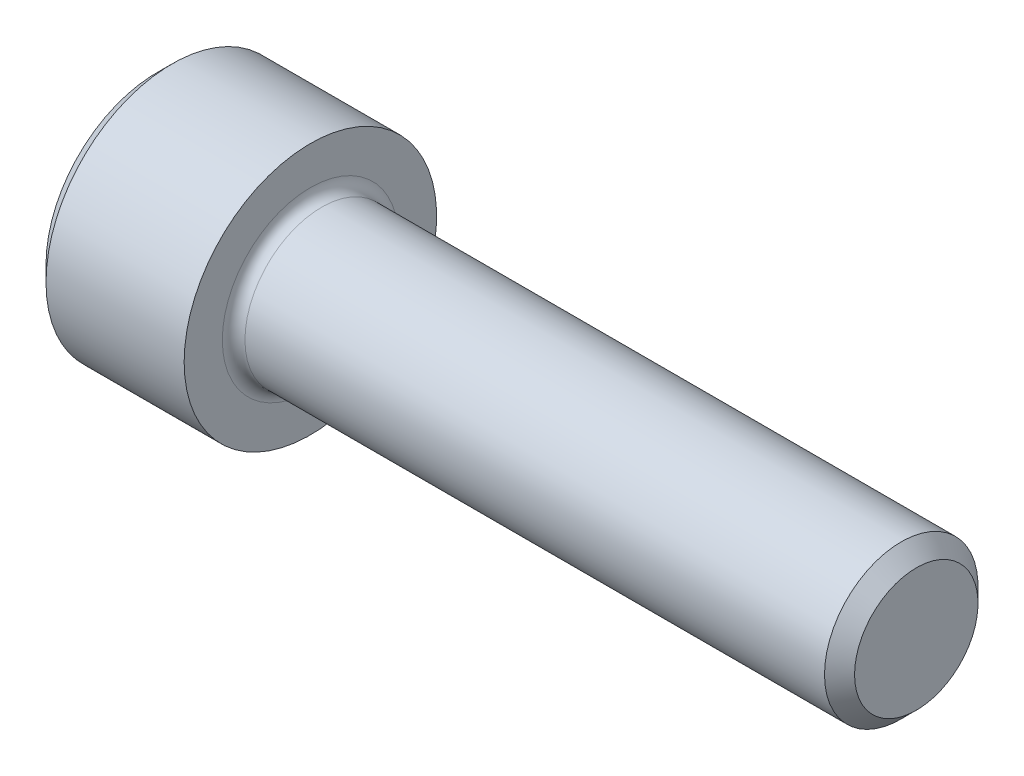
ISO-10303-21;
HEADER;
FILE_DESCRIPTION(('STEP AP214'),'2;1');
FILE_NAME('part.step','',(''),(''),'','','');
FILE_SCHEMA(('AUTOMOTIVE_DESIGN { 1 0 10303 214 1 1 1 1 }'));
ENDSEC;
DATA;
#1=APPLICATION_CONTEXT('core data for automotive mechanical design processes');
#2=APPLICATION_PROTOCOL_DEFINITION('international standard','automotive_design',2000,#1);
#3=PRODUCT_CONTEXT('',#1,'mechanical');
#4=PRODUCT('Part','Part','',(#3));
#5=PRODUCT_RELATED_PRODUCT_CATEGORY('part','',(#4));
#6=PRODUCT_DEFINITION_FORMATION('','',#4);
#7=PRODUCT_DEFINITION_CONTEXT('part definition',#1,'design');
#8=PRODUCT_DEFINITION('design','',#6,#7);
#9=PRODUCT_DEFINITION_SHAPE('','',#8);
#10=(LENGTH_UNIT() NAMED_UNIT(*) SI_UNIT(.MILLI.,.METRE.));
#11=(NAMED_UNIT(*) PLANE_ANGLE_UNIT() SI_UNIT($,.RADIAN.));
#12=(NAMED_UNIT(*) SI_UNIT($,.STERADIAN.) SOLID_ANGLE_UNIT());
#13=UNCERTAINTY_MEASURE_WITH_UNIT(LENGTH_MEASURE(1.E-05),#10,'distance_accuracy_value','');
#14=(GEOMETRIC_REPRESENTATION_CONTEXT(3) GLOBAL_UNCERTAINTY_ASSIGNED_CONTEXT((#13)) GLOBAL_UNIT_ASSIGNED_CONTEXT((#10,
#11,#12)) REPRESENTATION_CONTEXT('',''));
#15=CARTESIAN_POINT('',(0.,0.,0.));
#16=DIRECTION('',(0.,0.,1.));
#17=DIRECTION('',(1.,0.,0.));
#18=AXIS2_PLACEMENT_3D('',#15,#16,#17);
#19=CARTESIAN_POINT('',(2.286,3.4381381735323,-1.98501));
#20=DIRECTION('',(1.,0.,0.));
#21=DIRECTION('',(0.,0.,-1.));
#22=AXIS2_PLACEMENT_3D('',#19,#20,#21);
#23=PLANE('',#22);
#24=DIRECTION('',(0.,1.,0.));
#25=VECTOR('',#24,1.);
#26=CARTESIAN_POINT('',(2.286,3.4381381735323,1.98501));
#27=LINE('',#26,#25);
#28=CARTESIAN_POINT('',(2.28600000003503,0.,1.985009999957));
#29=VERTEX_POINT('',#28);
#30=CARTESIAN_POINT('',(2.286,-1.14604605784409,1.98501));
#31=VERTEX_POINT('',#30);
#32=EDGE_CURVE('E95',#29,#31,#27,.F.);
#33=ORIENTED_EDGE('',*,*,#32,.F.);
#34=CARTESIAN_POINT('',(2.28600000004166,0.,0.));
#35=DIRECTION('',(-1.,0.,0.));
#36=DIRECTION('',(0.,0.,1.));
#37=AXIS2_PLACEMENT_3D('',#34,#35,#36);
#38=CIRCLE('',#37,1.98500999999851);
#39=CARTESIAN_POINT('',(2.28600000002083,-1.7190690867655,0.992504999999628));
#40=VERTEX_POINT('',#39);
#41=EDGE_CURVE('E97',#29,#40,#38,.F.);
#42=ORIENTED_EDGE('',*,*,#41,.T.);
#43=DIRECTION('',(0.,-0.500000000000001,-0.866025403784438));
#44=VECTOR('',#43,1.);
#45=CARTESIAN_POINT('',(2.286,-1.14604605784409,1.98501));
#46=LINE('',#45,#44);
#47=EDGE_CURVE('E100',#31,#40,#46,.T.);
#48=ORIENTED_EDGE('',*,*,#47,.F.);
#49=EDGE_LOOP('',(#33,#42,#48));
#50=FACE_BOUND('',#49,.T.);
#51=ADVANCED_FACE('F16',(#50),#23,.F.);
#52=CARTESIAN_POINT('',(2.286,3.4381381735323,-1.98501));
#53=DIRECTION('',(1.,0.,0.));
#54=DIRECTION('',(0.,0.,-1.));
#55=AXIS2_PLACEMENT_3D('',#52,#53,#54);
#56=PLANE('',#55);
#57=DIRECTION('',(0.,-0.500000000000001,-0.866025403784438));
#58=VECTOR('',#57,1.);
#59=CARTESIAN_POINT('',(2.286,-1.71906908676614,0.992505));
#60=LINE('',#59,#58);
#61=CARTESIAN_POINT('',(2.286,-2.29209211568819,0.));
#62=VERTEX_POINT('',#61);
#63=EDGE_CURVE('E168',#40,#62,#60,.T.);
#64=ORIENTED_EDGE('',*,*,#63,.F.);
#65=CARTESIAN_POINT('',(2.28600000004166,0.,0.));
#66=DIRECTION('',(-1.,0.,0.));
#67=DIRECTION('',(0.,0.,1.));
#68=AXIS2_PLACEMENT_3D('',#65,#66,#67);
#69=CIRCLE('',#68,1.98500999999851);
#70=CARTESIAN_POINT('',(2.28600000002083,-1.7190690867655,-0.992504999999625));
#71=VERTEX_POINT('',#70);
#72=EDGE_CURVE('E115',#40,#71,#69,.F.);
#73=ORIENTED_EDGE('',*,*,#72,.T.);
#74=DIRECTION('',(0.,0.5,-0.866025403784439));
#75=VECTOR('',#74,1.);
#76=CARTESIAN_POINT('',(2.286,-2.29209211568819,0.));
#77=LINE('',#76,#75);
#78=EDGE_CURVE('E164',#62,#71,#77,.T.);
#79=ORIENTED_EDGE('',*,*,#78,.F.);
#80=EDGE_LOOP('',(#64,#73,#79));
#81=FACE_BOUND('',#80,.T.);
#82=ADVANCED_FACE('F340',(#81),#56,.F.);
#83=CARTESIAN_POINT('',(2.286,3.4381381735323,-1.98501));
#84=DIRECTION('',(1.,0.,0.));
#85=DIRECTION('',(0.,0.,-1.));
#86=AXIS2_PLACEMENT_3D('',#83,#84,#85);
#87=PLANE('',#86);
#88=DIRECTION('',(0.,0.499999999999998,-0.86602540378444));
#89=VECTOR('',#88,1.);
#90=CARTESIAN_POINT('',(2.286,-1.71906908676615,-0.992504999999995));
#91=LINE('',#90,#89);
#92=CARTESIAN_POINT('',(2.286,-1.1460460578441,-1.98501));
#93=VERTEX_POINT('',#92);
#94=EDGE_CURVE('E160',#71,#93,#91,.T.);
#95=ORIENTED_EDGE('',*,*,#94,.F.);
#96=CARTESIAN_POINT('',(2.28600000004166,0.,0.));
#97=DIRECTION('',(-1.,0.,0.));
#98=DIRECTION('',(0.,0.,1.));
#99=AXIS2_PLACEMENT_3D('',#96,#97,#98);
#100=CIRCLE('',#99,1.98500999999851);
#101=CARTESIAN_POINT('',(2.28600000003503,0.,-1.985009999957));
#102=VERTEX_POINT('',#101);
#103=EDGE_CURVE('E217',#71,#102,#100,.F.);
#104=ORIENTED_EDGE('',*,*,#103,.T.);
#105=DIRECTION('',(0.,1.,0.));
#106=VECTOR('',#105,1.);
#107=CARTESIAN_POINT('',(2.286,3.4381381735323,-1.98501));
#108=LINE('',#107,#106);
#109=EDGE_CURVE('E156',#93,#102,#108,.T.);
#110=ORIENTED_EDGE('',*,*,#109,.F.);
#111=EDGE_LOOP('',(#95,#104,#110));
#112=FACE_BOUND('',#111,.T.);
#113=ADVANCED_FACE('F337',(#112),#87,.F.);
#114=CARTESIAN_POINT('',(2.286,3.4381381735323,-1.98501));
#115=DIRECTION('',(1.,0.,0.));
#116=DIRECTION('',(0.,0.,-1.));
#117=AXIS2_PLACEMENT_3D('',#114,#115,#116);
#118=PLANE('',#117);
#119=DIRECTION('',(0.,1.,0.));
#120=VECTOR('',#119,1.);
#121=CARTESIAN_POINT('',(2.286,3.4381381735323,-1.98501));
#122=LINE('',#121,#120);
#123=CARTESIAN_POINT('',(2.286,1.1460460578441,-1.98501));
#124=VERTEX_POINT('',#123);
#125=EDGE_CURVE('E152',#102,#124,#122,.T.);
#126=ORIENTED_EDGE('',*,*,#125,.F.);
#127=CARTESIAN_POINT('',(2.28600000004166,0.,0.));
#128=DIRECTION('',(-1.,0.,0.));
#129=DIRECTION('',(0.,0.,1.));
#130=AXIS2_PLACEMENT_3D('',#127,#128,#129);
#131=CIRCLE('',#130,1.98500999999851);
#132=CARTESIAN_POINT('',(2.28600000002083,1.7190690867655,-0.992504999999631));
#133=VERTEX_POINT('',#132);
#134=EDGE_CURVE('E214',#102,#133,#131,.F.);
#135=ORIENTED_EDGE('',*,*,#134,.T.);
#136=DIRECTION('',(0.,0.500000000000002,0.866025403784438));
#137=VECTOR('',#136,1.);
#138=CARTESIAN_POINT('',(2.286,1.1460460578441,-1.98501));
#139=LINE('',#138,#137);
#140=EDGE_CURVE('E148',#124,#133,#139,.T.);
#141=ORIENTED_EDGE('',*,*,#140,.F.);
#142=EDGE_LOOP('',(#126,#135,#141));
#143=FACE_BOUND('',#142,.T.);
#144=ADVANCED_FACE('F333',(#143),#118,.F.);
#145=CARTESIAN_POINT('',(2.286,3.4381381735323,-1.98501));
#146=DIRECTION('',(1.,0.,0.));
#147=DIRECTION('',(0.,0.,-1.));
#148=AXIS2_PLACEMENT_3D('',#145,#146,#147);
#149=PLANE('',#148);
#150=DIRECTION('',(0.,0.500000000000001,0.866025403784438));
#151=VECTOR('',#150,1.);
#152=CARTESIAN_POINT('',(2.286,1.71906908676615,-0.992505000000005));
#153=LINE('',#152,#151);
#154=CARTESIAN_POINT('',(2.286,2.2920921156882,0.));
#155=VERTEX_POINT('',#154);
#156=EDGE_CURVE('E144',#133,#155,#153,.T.);
#157=ORIENTED_EDGE('',*,*,#156,.F.);
#158=CARTESIAN_POINT('',(2.28600000004166,0.,0.));
#159=DIRECTION('',(-1.,0.,0.));
#160=DIRECTION('',(0.,0.,1.));
#161=AXIS2_PLACEMENT_3D('',#158,#159,#160);
#162=CIRCLE('',#161,1.98500999999851);
#163=CARTESIAN_POINT('',(2.28600000002083,1.71906908676551,0.992504999999626));
#164=VERTEX_POINT('',#163);
#165=EDGE_CURVE('E123',#133,#164,#162,.F.);
#166=ORIENTED_EDGE('',*,*,#165,.T.);
#167=DIRECTION('',(0.,-0.499999999999999,0.866025403784439));
#168=VECTOR('',#167,1.);
#169=CARTESIAN_POINT('',(2.286,2.2920921156882,0.));
#170=LINE('',#169,#168);
#171=EDGE_CURVE('E116',#155,#164,#170,.T.);
#172=ORIENTED_EDGE('',*,*,#171,.F.);
#173=EDGE_LOOP('',(#157,#166,#172));
#174=FACE_BOUND('',#173,.T.);
#175=ADVANCED_FACE('F329',(#174),#149,.F.);
#176=CARTESIAN_POINT('',(2.28600000014012,0.,0.));
#177=DIRECTION('',(-1.,0.,0.));
#178=DIRECTION('',(0.,0.,1.));
#179=AXIS2_PLACEMENT_3D('',#176,#177,#178);
#180=CONICAL_SURFACE('',#179,1.98500999982798,1.04719755103067);
#181=CARTESIAN_POINT('',(3.43204605786696,0.,0.));
#182=VERTEX_POINT('',#181);
#183=VERTEX_LOOP('',#182);
#184=FACE_BOUND('',#183,.T.);
#185=ORIENTED_EDGE('',*,*,#41,.F.);
#186=CARTESIAN_POINT('',(2.28600000004166,0.,0.));
#187=DIRECTION('',(-1.,0.,0.));
#188=DIRECTION('',(0.,0.,1.));
#189=AXIS2_PLACEMENT_3D('',#186,#187,#188);
#190=CIRCLE('',#189,1.98500999999851);
#191=EDGE_CURVE('E111',#29,#164,#190,.T.);
#192=ORIENTED_EDGE('',*,*,#191,.T.);
#193=ORIENTED_EDGE('',*,*,#165,.F.);
#194=ORIENTED_EDGE('',*,*,#134,.F.);
#195=ORIENTED_EDGE('',*,*,#103,.F.);
#196=ORIENTED_EDGE('',*,*,#72,.F.);
#197=EDGE_LOOP('',(#185,#192,#193,#194,#195,#196));
#198=FACE_BOUND('',#197,.T.);
#199=ADVANCED_FACE('F109',(#184,#198),#180,.F.);
#200=CARTESIAN_POINT('',(2.286,3.4381381735323,-1.98501));
#201=DIRECTION('',(1.,0.,0.));
#202=DIRECTION('',(0.,0.,-1.));
#203=AXIS2_PLACEMENT_3D('',#200,#201,#202);
#204=PLANE('',#203);
#205=DIRECTION('',(0.,0.499999999999999,-0.866025403784439));
#206=VECTOR('',#205,1.);
#207=CARTESIAN_POINT('',(2.286,2.2920921156882,0.));
#208=LINE('',#207,#206);
#209=CARTESIAN_POINT('',(2.286,1.14604605784411,1.98501));
#210=VERTEX_POINT('',#209);
#211=EDGE_CURVE('E122',#164,#210,#208,.F.);
#212=ORIENTED_EDGE('',*,*,#211,.F.);
#213=ORIENTED_EDGE('',*,*,#191,.F.);
#214=DIRECTION('',(0.,-1.,0.));
#215=VECTOR('',#214,1.);
#216=CARTESIAN_POINT('',(2.286,-1.14604605784409,1.98501));
#217=LINE('',#216,#215);
#218=EDGE_CURVE('E120',#29,#210,#217,.F.);
#219=ORIENTED_EDGE('',*,*,#218,.T.);
#220=EDGE_LOOP('',(#212,#213,#219));
#221=FACE_BOUND('',#220,.T.);
#222=ADVANCED_FACE('F119',(#221),#204,.F.);
#223=CARTESIAN_POINT('',(2.286,2.2920921156882,0.));
#224=DIRECTION('',(0.,-0.866025403784439,-0.499999999999999));
#225=DIRECTION('',(0.,0.499999999999999,-0.866025403784439));
#226=AXIS2_PLACEMENT_3D('',#223,#224,#225);
#227=PLANE('',#226);
#228=ORIENTED_EDGE('',*,*,#211,.T.);
#229=DIRECTION('',(1.,0.,0.));
#230=VECTOR('',#229,1.);
#231=CARTESIAN_POINT('',(2.286,1.14604605784411,1.98501));
#232=LINE('',#231,#230);
#233=CARTESIAN_POINT('',(0.,1.14604605784411,1.98501));
#234=VERTEX_POINT('',#233);
#235=EDGE_CURVE('E128',#210,#234,#232,.F.);
#236=ORIENTED_EDGE('',*,*,#235,.T.);
#237=DIRECTION('',(0.,-0.499999999999999,0.866025403784439));
#238=VECTOR('',#237,1.);
#239=CARTESIAN_POINT('',(0.,2.2920921156882,0.));
#240=LINE('',#239,#238);
#241=CARTESIAN_POINT('',(0.,2.2920921156882,0.));
#242=VERTEX_POINT('',#241);
#243=EDGE_CURVE('E135',#242,#234,#240,.T.);
#244=ORIENTED_EDGE('',*,*,#243,.F.);
#245=DIRECTION('',(1.,0.,0.));
#246=VECTOR('',#245,1.);
#247=CARTESIAN_POINT('',(2.286,2.2920921156882,0.));
#248=LINE('',#247,#246);
#249=EDGE_CURVE('E179',#242,#155,#248,.T.);
#250=ORIENTED_EDGE('',*,*,#249,.T.);
#251=ORIENTED_EDGE('',*,*,#171,.T.);
#252=EDGE_LOOP('',(#228,#236,#244,#250,#251));
#253=FACE_BOUND('',#252,.T.);
#254=ADVANCED_FACE('F321',(#253),#227,.T.);
#255=CARTESIAN_POINT('',(2.286,-1.14604605784409,1.98501));
#256=DIRECTION('',(0.,0.,1.));
#257=DIRECTION('',(0.,-1.,0.));
#258=AXIS2_PLACEMENT_3D('',#255,#256,#257);
#259=PLANE('',#258);
#260=ORIENTED_EDGE('',*,*,#235,.F.);
#261=ORIENTED_EDGE('',*,*,#218,.F.);
#262=ORIENTED_EDGE('',*,*,#32,.T.);
#263=DIRECTION('',(1.,0.,0.));
#264=VECTOR('',#263,1.);
#265=CARTESIAN_POINT('',(2.286,-1.14604605784409,1.98501));
#266=LINE('',#265,#264);
#267=CARTESIAN_POINT('',(0.,-1.14604605784409,1.98501));
#268=VERTEX_POINT('',#267);
#269=EDGE_CURVE('E130',#268,#31,#266,.T.);
#270=ORIENTED_EDGE('',*,*,#269,.F.);
#271=DIRECTION('',(0.,1.,0.));
#272=VECTOR('',#271,1.);
#273=CARTESIAN_POINT('',(0.,0.,1.98501));
#274=LINE('',#273,#272);
#275=EDGE_CURVE('E364',#234,#268,#274,.F.);
#276=ORIENTED_EDGE('',*,*,#275,.F.);
#277=EDGE_LOOP('',(#260,#261,#262,#270,#276));
#278=FACE_BOUND('',#277,.T.);
#279=ADVANCED_FACE('F126',(#278),#259,.F.);
#280=CARTESIAN_POINT('',(2.286,-1.14604605784409,1.98501));
#281=DIRECTION('',(0.,0.866025403784438,-0.500000000000001));
#282=DIRECTION('',(0.,0.500000000000001,0.866025403784438));
#283=AXIS2_PLACEMENT_3D('',#280,#281,#282);
#284=PLANE('',#283);
#285=ORIENTED_EDGE('',*,*,#63,.T.);
#286=DIRECTION('',(1.,0.,0.));
#287=VECTOR('',#286,1.);
#288=CARTESIAN_POINT('',(2.286,-2.29209211568819,0.));
#289=LINE('',#288,#287);
#290=CARTESIAN_POINT('',(0.,-2.29209211568819,0.));
#291=VERTEX_POINT('',#290);
#292=EDGE_CURVE('E190',#291,#62,#289,.T.);
#293=ORIENTED_EDGE('',*,*,#292,.F.);
#294=DIRECTION('',(0.,-0.500000000000001,-0.866025403784438));
#295=VECTOR('',#294,1.);
#296=CARTESIAN_POINT('',(0.,-1.14604605784409,1.98501));
#297=LINE('',#296,#295);
#298=EDGE_CURVE('E360',#268,#291,#297,.T.);
#299=ORIENTED_EDGE('',*,*,#298,.F.);
#300=ORIENTED_EDGE('',*,*,#269,.T.);
#301=ORIENTED_EDGE('',*,*,#47,.T.);
#302=EDGE_LOOP('',(#285,#293,#299,#300,#301));
#303=FACE_BOUND('',#302,.T.);
#304=ADVANCED_FACE('F314',(#303),#284,.T.);
#305=CARTESIAN_POINT('',(2.286,-2.29209211568819,0.));
#306=DIRECTION('',(0.,0.866025403784439,0.499999999999999));
#307=DIRECTION('',(0.,-0.499999999999999,0.866025403784439));
#308=AXIS2_PLACEMENT_3D('',#305,#306,#307);
#309=PLANE('',#308);
#310=ORIENTED_EDGE('',*,*,#94,.T.);
#311=DIRECTION('',(1.,0.,0.));
#312=VECTOR('',#311,1.);
#313=CARTESIAN_POINT('',(2.286,-1.1460460578441,-1.98501));
#314=LINE('',#313,#312);
#315=CARTESIAN_POINT('',(0.,-1.1460460578441,-1.98501));
#316=VERTEX_POINT('',#315);
#317=EDGE_CURVE('E183',#93,#316,#314,.F.);
#318=ORIENTED_EDGE('',*,*,#317,.T.);
#319=DIRECTION('',(0.,0.499999999999999,-0.866025403784439));
#320=VECTOR('',#319,1.);
#321=CARTESIAN_POINT('',(0.,-2.29209211568819,0.));
#322=LINE('',#321,#320);
#323=EDGE_CURVE('E353',#291,#316,#322,.T.);
#324=ORIENTED_EDGE('',*,*,#323,.F.);
#325=ORIENTED_EDGE('',*,*,#292,.T.);
#326=ORIENTED_EDGE('',*,*,#78,.T.);
#327=EDGE_LOOP('',(#310,#318,#324,#325,#326));
#328=FACE_BOUND('',#327,.T.);
#329=ADVANCED_FACE('F310',(#328),#309,.T.);
#330=CARTESIAN_POINT('',(2.286,1.1460460578441,-1.98501));
#331=DIRECTION('',(0.,0.,-1.));
#332=DIRECTION('',(0.,1.,0.));
#333=AXIS2_PLACEMENT_3D('',#330,#331,#332);
#334=PLANE('',#333);
#335=ORIENTED_EDGE('',*,*,#317,.F.);
#336=ORIENTED_EDGE('',*,*,#109,.T.);
#337=ORIENTED_EDGE('',*,*,#125,.T.);
#338=DIRECTION('',(1.,0.,0.));
#339=VECTOR('',#338,1.);
#340=CARTESIAN_POINT('',(2.286,1.1460460578441,-1.98501));
#341=LINE('',#340,#339);
#342=CARTESIAN_POINT('',(0.,1.1460460578441,-1.98501));
#343=VERTEX_POINT('',#342);
#344=EDGE_CURVE('E182',#124,#343,#341,.F.);
#345=ORIENTED_EDGE('',*,*,#344,.T.);
#346=DIRECTION('',(0.,1.,0.));
#347=VECTOR('',#346,1.);
#348=CARTESIAN_POINT('',(0.,0.,-1.98501));
#349=LINE('',#348,#347);
#350=EDGE_CURVE('E359',#316,#343,#349,.T.);
#351=ORIENTED_EDGE('',*,*,#350,.F.);
#352=EDGE_LOOP('',(#335,#336,#337,#345,#351));
#353=FACE_BOUND('',#352,.T.);
#354=ADVANCED_FACE('F306',(#353),#334,.F.);
#355=CARTESIAN_POINT('',(2.286,2.2920921156882,0.));
#356=DIRECTION('',(0.,0.866025403784438,-0.500000000000001));
#357=DIRECTION('',(0.,0.500000000000001,0.866025403784438));
#358=AXIS2_PLACEMENT_3D('',#355,#356,#357);
#359=PLANE('',#358);
#360=ORIENTED_EDGE('',*,*,#344,.F.);
#361=ORIENTED_EDGE('',*,*,#140,.T.);
#362=ORIENTED_EDGE('',*,*,#156,.T.);
#363=ORIENTED_EDGE('',*,*,#249,.F.);
#364=DIRECTION('',(0.,0.500000000000001,0.866025403784438));
#365=VECTOR('',#364,1.);
#366=CARTESIAN_POINT('',(0.,1.1460460578441,-1.98501));
#367=LINE('',#366,#365);
#368=EDGE_CURVE('E210',#343,#242,#367,.T.);
#369=ORIENTED_EDGE('',*,*,#368,.F.);
#370=EDGE_LOOP('',(#360,#361,#362,#363,#369));
#371=FACE_BOUND('',#370,.T.);
#372=ADVANCED_FACE('F302',(#371),#359,.F.);
#373=CARTESIAN_POINT('',(0.,0.,0.));
#374=DIRECTION('',(-1.,0.,0.));
#375=DIRECTION('',(0.,0.,1.));
#376=AXIS2_PLACEMENT_3D('',#373,#374,#375);
#377=PLANE('',#376);
#378=CARTESIAN_POINT('',(0.,0.,0.));
#379=DIRECTION('',(1.,0.,0.));
#380=DIRECTION('',(0.,0.,-1.));
#381=AXIS2_PLACEMENT_3D('',#378,#379,#380);
#382=CIRCLE('',#381,3.48615000001473);
#383=CARTESIAN_POINT('',(0.,0.,-3.48615000001473));
#384=VERTEX_POINT('',#383);
#385=EDGE_CURVE('E208',#384,#384,#382,.T.);
#386=ORIENTED_EDGE('',*,*,#385,.F.);
#387=EDGE_LOOP('',(#386));
#388=FACE_BOUND('',#387,.T.);
#389=ORIENTED_EDGE('',*,*,#350,.T.);
#390=ORIENTED_EDGE('',*,*,#368,.T.);
#391=ORIENTED_EDGE('',*,*,#243,.T.);
#392=ORIENTED_EDGE('',*,*,#275,.T.);
#393=ORIENTED_EDGE('',*,*,#298,.T.);
#394=ORIENTED_EDGE('',*,*,#323,.T.);
#395=EDGE_LOOP('',(#389,#390,#391,#392,#393,#394));
#396=FACE_BOUND('',#395,.T.);
#397=ADVANCED_FACE('F294',(#388,#396),#377,.T.);
#398=CARTESIAN_POINT('',(0.482600000054845,0.,0.));
#399=DIRECTION('',(1.,0.,0.));
#400=DIRECTION('',(0.,0.,-1.));
#401=AXIS2_PLACEMENT_3D('',#398,#399,#400);
#402=CONICAL_SURFACE('',#401,3.96875000001273,0.785398163338555);
#403=ORIENTED_EDGE('',*,*,#385,.T.);
#404=EDGE_LOOP('',(#403));
#405=FACE_BOUND('',#404,.T.);
#406=CARTESIAN_POINT('',(0.4826,0.,0.));
#407=DIRECTION('',(-1.,0.,0.));
#408=DIRECTION('',(0.,0.,1.));
#409=AXIS2_PLACEMENT_3D('',#406,#407,#408);
#410=CIRCLE('',#409,3.96875);
#411=CARTESIAN_POINT('',(0.4826,0.,3.96875));
#412=VERTEX_POINT('',#411);
#413=EDGE_CURVE('E207',#412,#412,#410,.F.);
#414=ORIENTED_EDGE('',*,*,#413,.F.);
#415=EDGE_LOOP('',(#414));
#416=FACE_BOUND('',#415,.T.);
#417=ADVANCED_FACE('F289',(#405,#416),#402,.T.);
#418=CARTESIAN_POINT('',(-31.75,0.,0.));
#419=DIRECTION('',(-1.,0.,0.));
#420=DIRECTION('',(0.,0.,1.));
#421=AXIS2_PLACEMENT_3D('',#418,#419,#420);
#422=CYLINDRICAL_SURFACE('',#421,3.96875);
#423=CARTESIAN_POINT('',(4.826,0.,0.));
#424=DIRECTION('',(-1.,0.,0.));
#425=DIRECTION('',(0.,0.,1.));
#426=AXIS2_PLACEMENT_3D('',#423,#424,#425);
#427=CIRCLE('',#426,3.96875);
#428=CARTESIAN_POINT('',(4.826,0.,3.96875));
#429=VERTEX_POINT('',#428);
#430=EDGE_CURVE('E204',#429,#429,#427,.F.);
#431=ORIENTED_EDGE('',*,*,#430,.F.);
#432=EDGE_LOOP('',(#431));
#433=FACE_BOUND('',#432,.T.);
#434=ORIENTED_EDGE('',*,*,#413,.T.);
#435=EDGE_LOOP('',(#434));
#436=FACE_BOUND('',#435,.T.);
#437=ADVANCED_FACE('F285',(#433,#436),#422,.T.);
#438=CARTESIAN_POINT('',(23.876,1.94056,0.));
#439=DIRECTION('',(1.,0.,0.));
#440=DIRECTION('',(0.,0.,-1.));
#441=AXIS2_PLACEMENT_3D('',#438,#439,#440);
#442=PLANE('',#441);
#443=CARTESIAN_POINT('',(23.8759999999729,0.,0.));
#444=DIRECTION('',(-1.,0.,0.));
#445=DIRECTION('',(0.,0.,1.));
#446=AXIS2_PLACEMENT_3D('',#443,#444,#445);
#447=CIRCLE('',#446,1.94055999998);
#448=CARTESIAN_POINT('',(23.8759999999729,0.,1.94055999998));
#449=VERTEX_POINT('',#448);
#450=EDGE_CURVE('E200',#449,#449,#447,.T.);
#451=ORIENTED_EDGE('',*,*,#450,.F.);
#452=EDGE_LOOP('',(#451));
#453=FACE_BOUND('',#452,.T.);
#454=ADVANCED_FACE('F243',(#453),#442,.T.);
#455=CARTESIAN_POINT('',(4.826,3.96875,0.));
#456=DIRECTION('',(1.,0.,0.));
#457=DIRECTION('',(0.,0.,-1.));
#458=AXIS2_PLACEMENT_3D('',#455,#456,#457);
#459=PLANE('',#458);
#460=ORIENTED_EDGE('',*,*,#430,.T.);
#461=EDGE_LOOP('',(#460));
#462=FACE_BOUND('',#461,.T.);
#463=CARTESIAN_POINT('',(4.826,0.,0.));
#464=DIRECTION('',(1.,0.,0.));
#465=DIRECTION('',(0.,0.,1.));
#466=AXIS2_PLACEMENT_3D('',#463,#464,#465);
#467=CIRCLE('',#466,2.76859999999998);
#468=CARTESIAN_POINT('',(4.826,0.,-2.76859999999998));
#469=VERTEX_POINT('',#468);
#470=CARTESIAN_POINT('',(4.826,0.,2.76859999999998));
#471=VERTEX_POINT('',#470);
#472=EDGE_CURVE('E203',#469,#471,#467,.F.);
#473=ORIENTED_EDGE('',*,*,#472,.T.);
#474=CARTESIAN_POINT('',(4.826,0.,0.));
#475=DIRECTION('',(1.,0.,0.));
#476=DIRECTION('',(0.,0.,-1.));
#477=AXIS2_PLACEMENT_3D('',#474,#475,#476);
#478=CIRCLE('',#477,2.76859999999998);
#479=EDGE_CURVE('E35',#471,#469,#478,.F.);
#480=ORIENTED_EDGE('',*,*,#479,.T.);
#481=EDGE_LOOP('',(#473,#480));
#482=FACE_BOUND('',#481,.T.);
#483=ADVANCED_FACE('F224',(#462,#482),#459,.T.);
#484=CARTESIAN_POINT('',(23.4035599999061,0.,0.));
#485=DIRECTION('',(-1.,0.,0.));
#486=DIRECTION('',(0.,0.,1.));
#487=AXIS2_PLACEMENT_3D('',#484,#485,#486);
#488=CONICAL_SURFACE('',#487,2.41299999999001,0.785398163337289);
#489=CARTESIAN_POINT('',(23.40356,0.,0.));
#490=DIRECTION('',(-1.,0.,0.));
#491=DIRECTION('',(0.,0.,1.));
#492=AXIS2_PLACEMENT_3D('',#489,#490,#491);
#493=CIRCLE('',#492,2.41299999999998);
#494=CARTESIAN_POINT('',(23.40356,0.,2.41299999999998));
#495=VERTEX_POINT('',#494);
#496=EDGE_CURVE('E27',#495,#495,#493,.T.);
#497=ORIENTED_EDGE('',*,*,#496,.F.);
#498=EDGE_LOOP('',(#497));
#499=FACE_BOUND('',#498,.T.);
#500=ORIENTED_EDGE('',*,*,#450,.T.);
#501=EDGE_LOOP('',(#500));
#502=FACE_BOUND('',#501,.T.);
#503=ADVANCED_FACE('F242',(#499,#502),#488,.T.);
#504=CARTESIAN_POINT('',(5.1816,0.,0.));
#505=DIRECTION('',(1.,0.,0.));
#506=DIRECTION('',(0.,0.,-1.));
#507=AXIS2_PLACEMENT_3D('',#504,#505,#506);
#508=TOROIDAL_SURFACE('',#507,2.76859999999998,0.3556);
#509=CARTESIAN_POINT('',(5.1816,0.,0.));
#510=DIRECTION('',(-1.,0.,0.));
#511=DIRECTION('',(0.,0.,1.));
#512=AXIS2_PLACEMENT_3D('',#509,#510,#511);
#513=CIRCLE('',#512,2.41299999999998);
#514=CARTESIAN_POINT('',(5.1816,0.,2.41299999999998));
#515=VERTEX_POINT('',#514);
#516=EDGE_CURVE('E11',#515,#515,#513,.F.);
#517=ORIENTED_EDGE('',*,*,#516,.F.);
#518=EDGE_LOOP('',(#517));
#519=FACE_BOUND('',#518,.T.);
#520=ORIENTED_EDGE('',*,*,#472,.F.);
#521=ORIENTED_EDGE('',*,*,#479,.F.);
#522=EDGE_LOOP('',(#520,#521));
#523=FACE_BOUND('',#522,.T.);
#524=ADVANCED_FACE('F221',(#519,#523),#508,.F.);
#525=CARTESIAN_POINT('',(-31.75,0.,0.));
#526=DIRECTION('',(-1.,0.,0.));
#527=DIRECTION('',(0.,0.,1.));
#528=AXIS2_PLACEMENT_3D('',#525,#526,#527);
#529=CYLINDRICAL_SURFACE('',#528,2.41299999999998);
#530=ORIENTED_EDGE('',*,*,#516,.T.);
#531=EDGE_LOOP('',(#530));
#532=FACE_BOUND('',#531,.T.);
#533=ORIENTED_EDGE('',*,*,#496,.T.);
#534=EDGE_LOOP('',(#533));
#535=FACE_BOUND('',#534,.T.);
#536=ADVANCED_FACE('F267',(#532,#535),#529,.T.);
#537=CLOSED_SHELL('',(#51,#82,#113,#144,#175,#199,#222,#254,#279,#304,#329,#354,#372,#397,#417,
#437,#454,#483,#503,#524,#536));
#538=MANIFOLD_SOLID_BREP('B1',#537);
#539=ADVANCED_BREP_SHAPE_REPRESENTATION('',(#18,#538),#14);
#540=SHAPE_DEFINITION_REPRESENTATION(#9,#539);
ENDSEC;
END-ISO-10303-21;
